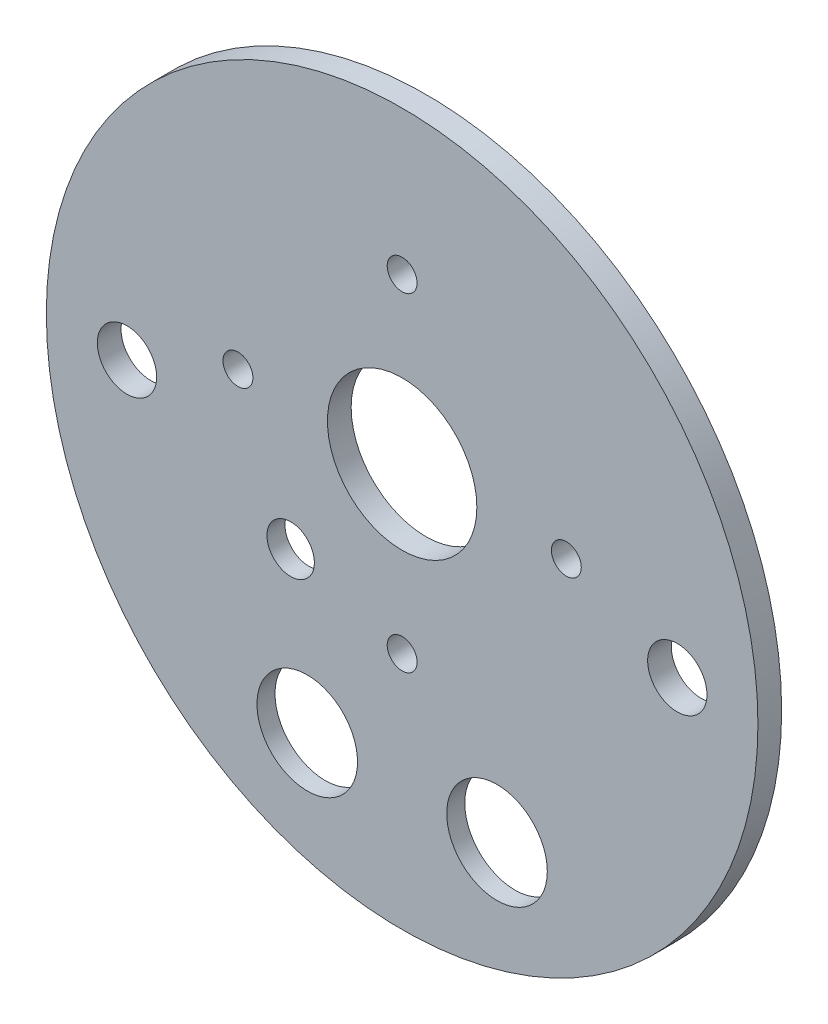
ISO-10303-21;
HEADER;
FILE_DESCRIPTION(('STEP AP214'),'2;1');
FILE_NAME('part.step','',(''),(''),'','','');
FILE_SCHEMA(('AUTOMOTIVE_DESIGN { 1 0 10303 214 1 1 1 1 }'));
ENDSEC;
DATA;
#1=APPLICATION_CONTEXT('core data for automotive mechanical design processes');
#2=APPLICATION_PROTOCOL_DEFINITION('international standard','automotive_design',2000,#1);
#3=PRODUCT_CONTEXT('',#1,'mechanical');
#4=PRODUCT('Part','Part','',(#3));
#5=PRODUCT_RELATED_PRODUCT_CATEGORY('part','',(#4));
#6=PRODUCT_DEFINITION_FORMATION('','',#4);
#7=PRODUCT_DEFINITION_CONTEXT('part definition',#1,'design');
#8=PRODUCT_DEFINITION('design','',#6,#7);
#9=PRODUCT_DEFINITION_SHAPE('','',#8);
#10=(LENGTH_UNIT() NAMED_UNIT(*) SI_UNIT(.MILLI.,.METRE.));
#11=(NAMED_UNIT(*) PLANE_ANGLE_UNIT() SI_UNIT($,.RADIAN.));
#12=(NAMED_UNIT(*) SI_UNIT($,.STERADIAN.) SOLID_ANGLE_UNIT());
#13=UNCERTAINTY_MEASURE_WITH_UNIT(LENGTH_MEASURE(1.E-05),#10,'distance_accuracy_value','');
#14=(GEOMETRIC_REPRESENTATION_CONTEXT(3) GLOBAL_UNCERTAINTY_ASSIGNED_CONTEXT((#13)) GLOBAL_UNIT_ASSIGNED_CONTEXT((#10,
#11,#12)) REPRESENTATION_CONTEXT('',''));
#15=CARTESIAN_POINT('',(0.,0.,0.));
#16=DIRECTION('',(0.,0.,1.));
#17=DIRECTION('',(1.,0.,0.));
#18=AXIS2_PLACEMENT_3D('',#15,#16,#17);
#19=CARTESIAN_POINT('',(-12.7,-31.1667936271924,0.));
#20=DIRECTION('',(0.,0.,1.));
#21=DIRECTION('',(1.,0.,0.));
#22=AXIS2_PLACEMENT_3D('',#19,#20,#21);
#23=CYLINDRICAL_SURFACE('',#22,6.731);
#24=CARTESIAN_POINT('',(-12.7,-31.1667936271924,8.255));
#25=DIRECTION('',(0.,0.,1.));
#26=DIRECTION('',(1.,0.,0.));
#27=AXIS2_PLACEMENT_3D('',#24,#25,#26);
#28=CIRCLE('',#27,6.731);
#29=CARTESIAN_POINT('',(-5.969,-31.1667936271924,8.255));
#30=VERTEX_POINT('',#29);
#31=EDGE_CURVE('E40',#30,#30,#28,.T.);
#32=ORIENTED_EDGE('',*,*,#31,.T.);
#33=EDGE_LOOP('',(#32));
#34=FACE_BOUND('',#33,.T.);
#35=CARTESIAN_POINT('',(-12.7,-31.1667936271924,5.842));
#36=DIRECTION('',(0.,0.,-1.));
#37=DIRECTION('',(-1.,0.,0.));
#38=AXIS2_PLACEMENT_3D('',#35,#36,#37);
#39=CIRCLE('',#38,6.731);
#40=CARTESIAN_POINT('',(-19.431,-31.1667936271924,5.842));
#41=VERTEX_POINT('',#40);
#42=EDGE_CURVE('E36',#41,#41,#39,.F.);
#43=ORIENTED_EDGE('',*,*,#42,.F.);
#44=EDGE_LOOP('',(#43));
#45=FACE_BOUND('',#44,.T.);
#46=ADVANCED_FACE('F32',(#34,#45),#23,.F.);
#47=CARTESIAN_POINT('',(-14.9213454566843,-10.9685752809603,0.));
#48=DIRECTION('',(0.,0.,1.));
#49=DIRECTION('',(1.,0.,0.));
#50=AXIS2_PLACEMENT_3D('',#47,#48,#49);
#51=CYLINDRICAL_SURFACE('',#50,3.175);
#52=CARTESIAN_POINT('',(-14.9213454566843,-10.9685752809603,8.255));
#53=DIRECTION('',(0.,0.,1.));
#54=DIRECTION('',(1.,0.,0.));
#55=AXIS2_PLACEMENT_3D('',#52,#53,#54);
#56=CIRCLE('',#55,3.175);
#57=CARTESIAN_POINT('',(-11.7463454566843,-10.9685752809603,8.255));
#58=VERTEX_POINT('',#57);
#59=EDGE_CURVE('E125',#58,#58,#56,.T.);
#60=ORIENTED_EDGE('',*,*,#59,.T.);
#61=EDGE_LOOP('',(#60));
#62=FACE_BOUND('',#61,.T.);
#63=CARTESIAN_POINT('',(-14.9213454566843,-10.9685752809603,5.842));
#64=DIRECTION('',(0.,0.,-1.));
#65=DIRECTION('',(-1.,0.,0.));
#66=AXIS2_PLACEMENT_3D('',#63,#64,#65);
#67=CIRCLE('',#66,3.175);
#68=CARTESIAN_POINT('',(-18.0963454566843,-10.9685752809603,5.842));
#69=VERTEX_POINT('',#68);
#70=EDGE_CURVE('E55',#69,#69,#67,.F.);
#71=ORIENTED_EDGE('',*,*,#70,.F.);
#72=EDGE_LOOP('',(#71));
#73=FACE_BOUND('',#72,.T.);
#74=ADVANCED_FACE('F66',(#62,#73),#51,.F.);
#75=CARTESIAN_POINT('',(12.7,-31.1667936271924,0.));
#76=DIRECTION('',(0.,0.,1.));
#77=DIRECTION('',(1.,0.,0.));
#78=AXIS2_PLACEMENT_3D('',#75,#76,#77);
#79=CYLINDRICAL_SURFACE('',#78,6.731);
#80=CARTESIAN_POINT('',(12.7,-31.1667936271924,8.255));
#81=DIRECTION('',(0.,0.,1.));
#82=DIRECTION('',(1.,0.,0.));
#83=AXIS2_PLACEMENT_3D('',#80,#81,#82);
#84=CIRCLE('',#83,6.731);
#85=CARTESIAN_POINT('',(19.431,-31.1667936271924,8.255));
#86=VERTEX_POINT('',#85);
#87=EDGE_CURVE('E45',#86,#86,#84,.T.);
#88=ORIENTED_EDGE('',*,*,#87,.T.);
#89=EDGE_LOOP('',(#88));
#90=FACE_BOUND('',#89,.T.);
#91=CARTESIAN_POINT('',(12.7,-31.1667936271924,5.842));
#92=DIRECTION('',(0.,0.,-1.));
#93=DIRECTION('',(-1.,0.,0.));
#94=AXIS2_PLACEMENT_3D('',#91,#92,#93);
#95=CIRCLE('',#94,6.731);
#96=CARTESIAN_POINT('',(5.96899999999999,-31.1667936271924,5.842));
#97=VERTEX_POINT('',#96);
#98=EDGE_CURVE('E53',#97,#97,#95,.F.);
#99=ORIENTED_EDGE('',*,*,#98,.F.);
#100=EDGE_LOOP('',(#99));
#101=FACE_BOUND('',#100,.T.);
#102=ADVANCED_FACE('F72',(#90,#101),#79,.F.);
#103=CARTESIAN_POINT('',(0.,28.3268787592779,0.));
#104=DIRECTION('',(0.,0.,1.));
#105=DIRECTION('',(1.,0.,0.));
#106=AXIS2_PLACEMENT_3D('',#103,#104,#105);
#107=CYLINDRICAL_SURFACE('',#106,2.);
#108=CARTESIAN_POINT('',(0.,28.3268787592779,8.255));
#109=DIRECTION('',(0.,0.,1.));
#110=DIRECTION('',(1.,0.,0.));
#111=AXIS2_PLACEMENT_3D('',#108,#109,#110);
#112=CIRCLE('',#111,2.);
#113=CARTESIAN_POINT('',(2.,28.3268787592779,8.255));
#114=VERTEX_POINT('',#113);
#115=EDGE_CURVE('E121',#114,#114,#112,.T.);
#116=ORIENTED_EDGE('',*,*,#115,.T.);
#117=EDGE_LOOP('',(#116));
#118=FACE_BOUND('',#117,.T.);
#119=CARTESIAN_POINT('',(0.,28.3268787592779,5.08));
#120=DIRECTION('',(0.,0.,-1.));
#121=DIRECTION('',(-1.,0.,0.));
#122=AXIS2_PLACEMENT_3D('',#119,#120,#121);
#123=CIRCLE('',#122,2.);
#124=CARTESIAN_POINT('',(-2.00000000000001,28.3268787592779,5.08));
#125=VERTEX_POINT('',#124);
#126=EDGE_CURVE('E131',#125,#125,#123,.F.);
#127=ORIENTED_EDGE('',*,*,#126,.F.);
#128=EDGE_LOOP('',(#127));
#129=FACE_BOUND('',#128,.T.);
#130=ADVANCED_FACE('F163',(#118,#129),#107,.F.);
#131=CARTESIAN_POINT('',(36.83,0.,0.));
#132=DIRECTION('',(0.,0.,1.));
#133=DIRECTION('',(1.,0.,0.));
#134=AXIS2_PLACEMENT_3D('',#131,#132,#133);
#135=CYLINDRICAL_SURFACE('',#134,3.96875);
#136=CARTESIAN_POINT('',(36.83,0.,8.255));
#137=DIRECTION('',(0.,0.,1.));
#138=DIRECTION('',(1.,0.,0.));
#139=AXIS2_PLACEMENT_3D('',#136,#137,#138);
#140=CIRCLE('',#139,3.96875);
#141=CARTESIAN_POINT('',(40.79875,0.,8.255));
#142=VERTEX_POINT('',#141);
#143=EDGE_CURVE('E117',#142,#142,#140,.T.);
#144=ORIENTED_EDGE('',*,*,#143,.T.);
#145=EDGE_LOOP('',(#144));
#146=FACE_BOUND('',#145,.T.);
#147=CARTESIAN_POINT('',(36.83,0.,5.08));
#148=DIRECTION('',(0.,0.,-1.));
#149=DIRECTION('',(-1.,0.,0.));
#150=AXIS2_PLACEMENT_3D('',#147,#148,#149);
#151=CIRCLE('',#150,3.96875);
#152=CARTESIAN_POINT('',(32.86125,0.,5.08));
#153=VERTEX_POINT('',#152);
#154=EDGE_CURVE('E149',#153,#153,#151,.F.);
#155=ORIENTED_EDGE('',*,*,#154,.F.);
#156=EDGE_LOOP('',(#155));
#157=FACE_BOUND('',#156,.T.);
#158=ADVANCED_FACE('F144',(#146,#157),#135,.F.);
#159=CARTESIAN_POINT('',(-36.83,0.,0.));
#160=DIRECTION('',(0.,0.,1.));
#161=DIRECTION('',(1.,0.,0.));
#162=AXIS2_PLACEMENT_3D('',#159,#160,#161);
#163=CYLINDRICAL_SURFACE('',#162,3.96875);
#164=CARTESIAN_POINT('',(-36.83,0.,8.255));
#165=DIRECTION('',(0.,0.,1.));
#166=DIRECTION('',(1.,0.,0.));
#167=AXIS2_PLACEMENT_3D('',#164,#165,#166);
#168=CIRCLE('',#167,3.96875);
#169=CARTESIAN_POINT('',(-32.86125,0.,8.255));
#170=VERTEX_POINT('',#169);
#171=EDGE_CURVE('E113',#170,#170,#168,.T.);
#172=ORIENTED_EDGE('',*,*,#171,.T.);
#173=EDGE_LOOP('',(#172));
#174=FACE_BOUND('',#173,.T.);
#175=CARTESIAN_POINT('',(-36.83,0.,5.08));
#176=DIRECTION('',(0.,0.,-1.));
#177=DIRECTION('',(-1.,0.,0.));
#178=AXIS2_PLACEMENT_3D('',#175,#176,#177);
#179=CIRCLE('',#178,3.96875);
#180=CARTESIAN_POINT('',(-40.79875,0.,5.08));
#181=VERTEX_POINT('',#180);
#182=EDGE_CURVE('E147',#181,#181,#179,.F.);
#183=ORIENTED_EDGE('',*,*,#182,.F.);
#184=EDGE_LOOP('',(#183));
#185=FACE_BOUND('',#184,.T.);
#186=ADVANCED_FACE('F76',(#174,#185),#163,.F.);
#187=CARTESIAN_POINT('',(0.,6.35,0.));
#188=DIRECTION('',(0.,0.,1.));
#189=DIRECTION('',(1.,0.,0.));
#190=AXIS2_PLACEMENT_3D('',#187,#188,#189);
#191=CYLINDRICAL_SURFACE('',#190,10.);
#192=CARTESIAN_POINT('',(0.,6.35,8.255));
#193=DIRECTION('',(0.,0.,1.));
#194=DIRECTION('',(1.,0.,0.));
#195=AXIS2_PLACEMENT_3D('',#192,#193,#194);
#196=CIRCLE('',#195,10.);
#197=CARTESIAN_POINT('',(10.,6.35,8.255));
#198=VERTEX_POINT('',#197);
#199=EDGE_CURVE('E106',#198,#198,#196,.T.);
#200=ORIENTED_EDGE('',*,*,#199,.T.);
#201=EDGE_LOOP('',(#200));
#202=FACE_BOUND('',#201,.T.);
#203=CARTESIAN_POINT('',(0.,6.35,5.08));
#204=DIRECTION('',(0.,0.,-1.));
#205=DIRECTION('',(-1.,0.,0.));
#206=AXIS2_PLACEMENT_3D('',#203,#204,#205);
#207=CIRCLE('',#206,10.);
#208=CARTESIAN_POINT('',(-10.,6.35,5.08));
#209=VERTEX_POINT('',#208);
#210=EDGE_CURVE('E150',#209,#209,#207,.F.);
#211=ORIENTED_EDGE('',*,*,#210,.F.);
#212=EDGE_LOOP('',(#211));
#213=FACE_BOUND('',#212,.T.);
#214=ADVANCED_FACE('F143',(#202,#213),#191,.F.);
#215=CARTESIAN_POINT('',(-21.9768787592779,6.35,0.));
#216=DIRECTION('',(0.,0.,1.));
#217=DIRECTION('',(1.,0.,0.));
#218=AXIS2_PLACEMENT_3D('',#215,#216,#217);
#219=CYLINDRICAL_SURFACE('',#218,2.);
#220=CARTESIAN_POINT('',(-21.9768787592779,6.35,8.255));
#221=DIRECTION('',(0.,0.,1.));
#222=DIRECTION('',(1.,0.,0.));
#223=AXIS2_PLACEMENT_3D('',#220,#221,#222);
#224=CIRCLE('',#223,2.);
#225=CARTESIAN_POINT('',(-19.9768787592779,6.35,8.255));
#226=VERTEX_POINT('',#225);
#227=EDGE_CURVE('E102',#226,#226,#224,.T.);
#228=ORIENTED_EDGE('',*,*,#227,.T.);
#229=EDGE_LOOP('',(#228));
#230=FACE_BOUND('',#229,.T.);
#231=CARTESIAN_POINT('',(-21.9768787592779,6.35,5.08));
#232=DIRECTION('',(0.,0.,-1.));
#233=DIRECTION('',(-1.,0.,0.));
#234=AXIS2_PLACEMENT_3D('',#231,#232,#233);
#235=CIRCLE('',#234,2.);
#236=CARTESIAN_POINT('',(-23.9768787592779,6.35,5.08));
#237=VERTEX_POINT('',#236);
#238=EDGE_CURVE('E155',#237,#237,#235,.F.);
#239=ORIENTED_EDGE('',*,*,#238,.F.);
#240=EDGE_LOOP('',(#239));
#241=FACE_BOUND('',#240,.T.);
#242=ADVANCED_FACE('F178',(#230,#241),#219,.F.);
#243=CARTESIAN_POINT('',(0.,-15.6268787592779,0.));
#244=DIRECTION('',(0.,0.,1.));
#245=DIRECTION('',(1.,0.,0.));
#246=AXIS2_PLACEMENT_3D('',#243,#244,#245);
#247=CYLINDRICAL_SURFACE('',#246,2.);
#248=CARTESIAN_POINT('',(0.,-15.6268787592779,8.255));
#249=DIRECTION('',(0.,0.,1.));
#250=DIRECTION('',(1.,0.,0.));
#251=AXIS2_PLACEMENT_3D('',#248,#249,#250);
#252=CIRCLE('',#251,2.);
#253=CARTESIAN_POINT('',(2.,-15.6268787592779,8.255));
#254=VERTEX_POINT('',#253);
#255=EDGE_CURVE('E98',#254,#254,#252,.T.);
#256=ORIENTED_EDGE('',*,*,#255,.T.);
#257=EDGE_LOOP('',(#256));
#258=FACE_BOUND('',#257,.T.);
#259=CARTESIAN_POINT('',(0.,-15.6268787592779,5.08));
#260=DIRECTION('',(0.,0.,-1.));
#261=DIRECTION('',(-1.,0.,0.));
#262=AXIS2_PLACEMENT_3D('',#259,#260,#261);
#263=CIRCLE('',#262,2.);
#264=CARTESIAN_POINT('',(-2.,-15.6268787592779,5.08));
#265=VERTEX_POINT('',#264);
#266=EDGE_CURVE('E52',#265,#265,#263,.F.);
#267=ORIENTED_EDGE('',*,*,#266,.F.);
#268=EDGE_LOOP('',(#267));
#269=FACE_BOUND('',#268,.T.);
#270=ADVANCED_FACE('F175',(#258,#269),#247,.F.);
#271=CARTESIAN_POINT('',(21.9768787592779,6.35,0.));
#272=DIRECTION('',(0.,0.,1.));
#273=DIRECTION('',(1.,0.,0.));
#274=AXIS2_PLACEMENT_3D('',#271,#272,#273);
#275=CYLINDRICAL_SURFACE('',#274,2.);
#276=CARTESIAN_POINT('',(21.9768787592779,6.35,8.255));
#277=DIRECTION('',(0.,0.,1.));
#278=DIRECTION('',(1.,0.,0.));
#279=AXIS2_PLACEMENT_3D('',#276,#277,#278);
#280=CIRCLE('',#279,2.);
#281=CARTESIAN_POINT('',(23.9768787592779,6.35,8.255));
#282=VERTEX_POINT('',#281);
#283=EDGE_CURVE('E94',#282,#282,#280,.T.);
#284=ORIENTED_EDGE('',*,*,#283,.T.);
#285=EDGE_LOOP('',(#284));
#286=FACE_BOUND('',#285,.T.);
#287=CARTESIAN_POINT('',(21.9768787592779,6.35,5.08));
#288=DIRECTION('',(0.,0.,-1.));
#289=DIRECTION('',(-1.,0.,0.));
#290=AXIS2_PLACEMENT_3D('',#287,#288,#289);
#291=CIRCLE('',#290,2.);
#292=CARTESIAN_POINT('',(19.9768787592779,6.35,5.08));
#293=VERTEX_POINT('',#292);
#294=EDGE_CURVE('E49',#293,#293,#291,.F.);
#295=ORIENTED_EDGE('',*,*,#294,.F.);
#296=EDGE_LOOP('',(#295));
#297=FACE_BOUND('',#296,.T.);
#298=ADVANCED_FACE('F89',(#286,#297),#275,.F.);
#299=CARTESIAN_POINT('',(0.,0.,8.255));
#300=DIRECTION('',(0.,0.,-1.));
#301=DIRECTION('',(-1.,0.,0.));
#302=AXIS2_PLACEMENT_3D('',#299,#300,#301);
#303=CYLINDRICAL_SURFACE('',#302,47.625);
#304=CARTESIAN_POINT('',(0.,0.,8.255));
#305=DIRECTION('',(0.,0.,1.));
#306=DIRECTION('',(1.,0.,0.));
#307=AXIS2_PLACEMENT_3D('',#304,#305,#306);
#308=CIRCLE('',#307,47.625);
#309=CARTESIAN_POINT('',(47.625,0.,8.255));
#310=VERTEX_POINT('',#309);
#311=EDGE_CURVE('E10',#310,#310,#308,.T.);
#312=ORIENTED_EDGE('',*,*,#311,.F.);
#313=EDGE_LOOP('',(#312));
#314=FACE_BOUND('',#313,.T.);
#315=CARTESIAN_POINT('',(0.,0.,5.08));
#316=DIRECTION('',(0.,0.,-1.));
#317=DIRECTION('',(-1.,0.,0.));
#318=AXIS2_PLACEMENT_3D('',#315,#316,#317);
#319=CIRCLE('',#318,47.625);
#320=CARTESIAN_POINT('',(-47.625,0.,5.08));
#321=VERTEX_POINT('',#320);
#322=EDGE_CURVE('E127',#321,#321,#319,.T.);
#323=ORIENTED_EDGE('',*,*,#322,.F.);
#324=EDGE_LOOP('',(#323));
#325=FACE_BOUND('',#324,.T.);
#326=ADVANCED_FACE('F34',(#314,#325),#303,.T.);
#327=CARTESIAN_POINT('',(0.,0.,8.255));
#328=DIRECTION('',(0.,0.,1.));
#329=DIRECTION('',(1.,0.,0.));
#330=AXIS2_PLACEMENT_3D('',#327,#328,#329);
#331=PLANE('',#330);
#332=ORIENTED_EDGE('',*,*,#283,.F.);
#333=EDGE_LOOP('',(#332));
#334=FACE_BOUND('',#333,.T.);
#335=ORIENTED_EDGE('',*,*,#255,.F.);
#336=EDGE_LOOP('',(#335));
#337=FACE_BOUND('',#336,.T.);
#338=ORIENTED_EDGE('',*,*,#227,.F.);
#339=EDGE_LOOP('',(#338));
#340=FACE_BOUND('',#339,.T.);
#341=ORIENTED_EDGE('',*,*,#199,.F.);
#342=EDGE_LOOP('',(#341));
#343=FACE_BOUND('',#342,.T.);
#344=ORIENTED_EDGE('',*,*,#87,.F.);
#345=EDGE_LOOP('',(#344));
#346=FACE_BOUND('',#345,.T.);
#347=ORIENTED_EDGE('',*,*,#171,.F.);
#348=EDGE_LOOP('',(#347));
#349=FACE_BOUND('',#348,.T.);
#350=ORIENTED_EDGE('',*,*,#143,.F.);
#351=EDGE_LOOP('',(#350));
#352=FACE_BOUND('',#351,.T.);
#353=ORIENTED_EDGE('',*,*,#115,.F.);
#354=EDGE_LOOP('',(#353));
#355=FACE_BOUND('',#354,.T.);
#356=ORIENTED_EDGE('',*,*,#59,.F.);
#357=EDGE_LOOP('',(#356));
#358=FACE_BOUND('',#357,.T.);
#359=ORIENTED_EDGE('',*,*,#31,.F.);
#360=EDGE_LOOP('',(#359));
#361=FACE_BOUND('',#360,.T.);
#362=ORIENTED_EDGE('',*,*,#311,.T.);
#363=EDGE_LOOP('',(#362));
#364=FACE_BOUND('',#363,.T.);
#365=ADVANCED_FACE('F78',(#334,#337,#340,#343,#346,#349,#352,#355,#358,#361,#364),#331,.T.);
#366=CARTESIAN_POINT('',(0.,0.,5.08));
#367=DIRECTION('',(0.,0.,-1.));
#368=DIRECTION('',(-1.,0.,0.));
#369=AXIS2_PLACEMENT_3D('',#366,#367,#368);
#370=PLANE('',#369);
#371=CARTESIAN_POINT('',(12.7,-31.1667936271924,5.08));
#372=DIRECTION('',(0.,0.,-1.));
#373=DIRECTION('',(-1.,0.,0.));
#374=AXIS2_PLACEMENT_3D('',#371,#372,#373);
#375=CIRCLE('',#374,11.176);
#376=CARTESIAN_POINT('',(1.524,-31.1667936271924,5.08));
#377=VERTEX_POINT('',#376);
#378=EDGE_CURVE('E217',#377,#377,#375,.T.);
#379=ORIENTED_EDGE('',*,*,#378,.F.);
#380=EDGE_LOOP('',(#379));
#381=FACE_BOUND('',#380,.T.);
#382=CARTESIAN_POINT('',(-12.7,-31.1667936271924,5.08));
#383=DIRECTION('',(0.,0.,-1.));
#384=DIRECTION('',(-1.,0.,0.));
#385=AXIS2_PLACEMENT_3D('',#382,#383,#384);
#386=CIRCLE('',#385,11.176);
#387=CARTESIAN_POINT('',(-23.876,-31.1667936271924,5.08));
#388=VERTEX_POINT('',#387);
#389=EDGE_CURVE('E225',#388,#388,#386,.T.);
#390=ORIENTED_EDGE('',*,*,#389,.F.);
#391=EDGE_LOOP('',(#390));
#392=FACE_BOUND('',#391,.T.);
#393=CARTESIAN_POINT('',(-14.9213454566843,-10.9685752809603,5.08));
#394=DIRECTION('',(0.,0.,-1.));
#395=DIRECTION('',(-1.,0.,0.));
#396=AXIS2_PLACEMENT_3D('',#393,#394,#395);
#397=CIRCLE('',#396,6.35);
#398=CARTESIAN_POINT('',(-21.2713454566843,-10.9685752809603,5.08));
#399=VERTEX_POINT('',#398);
#400=EDGE_CURVE('E231',#399,#399,#397,.T.);
#401=ORIENTED_EDGE('',*,*,#400,.F.);
#402=EDGE_LOOP('',(#401));
#403=FACE_BOUND('',#402,.T.);
#404=ORIENTED_EDGE('',*,*,#126,.T.);
#405=EDGE_LOOP('',(#404));
#406=FACE_BOUND('',#405,.T.);
#407=ORIENTED_EDGE('',*,*,#154,.T.);
#408=EDGE_LOOP('',(#407));
#409=FACE_BOUND('',#408,.T.);
#410=ORIENTED_EDGE('',*,*,#182,.T.);
#411=EDGE_LOOP('',(#410));
#412=FACE_BOUND('',#411,.T.);
#413=ORIENTED_EDGE('',*,*,#210,.T.);
#414=EDGE_LOOP('',(#413));
#415=FACE_BOUND('',#414,.T.);
#416=ORIENTED_EDGE('',*,*,#238,.T.);
#417=EDGE_LOOP('',(#416));
#418=FACE_BOUND('',#417,.T.);
#419=ORIENTED_EDGE('',*,*,#266,.T.);
#420=EDGE_LOOP('',(#419));
#421=FACE_BOUND('',#420,.T.);
#422=ORIENTED_EDGE('',*,*,#294,.T.);
#423=EDGE_LOOP('',(#422));
#424=FACE_BOUND('',#423,.T.);
#425=ORIENTED_EDGE('',*,*,#322,.T.);
#426=EDGE_LOOP('',(#425));
#427=FACE_BOUND('',#426,.T.);
#428=ADVANCED_FACE('F80',(#381,#392,#403,#406,#409,#412,#415,#418,#421,#424,#427),#370,.T.);
#429=CARTESIAN_POINT('',(-14.9213454566843,-10.9685752809603,5.842));
#430=DIRECTION('',(0.,0.,-1.));
#431=DIRECTION('',(-1.,0.,0.));
#432=AXIS2_PLACEMENT_3D('',#429,#430,#431);
#433=PLANE('',#432);
#434=CARTESIAN_POINT('',(-14.9213454566843,-10.9685752809603,5.842));
#435=DIRECTION('',(0.,0.,-1.));
#436=DIRECTION('',(-1.,0.,0.));
#437=AXIS2_PLACEMENT_3D('',#434,#435,#436);
#438=CIRCLE('',#437,6.35);
#439=CARTESIAN_POINT('',(-21.2713454566843,-10.9685752809603,5.842));
#440=VERTEX_POINT('',#439);
#441=EDGE_CURVE('E228',#440,#440,#438,.T.);
#442=ORIENTED_EDGE('',*,*,#441,.T.);
#443=EDGE_LOOP('',(#442));
#444=FACE_BOUND('',#443,.T.);
#445=ORIENTED_EDGE('',*,*,#70,.T.);
#446=EDGE_LOOP('',(#445));
#447=FACE_BOUND('',#446,.T.);
#448=ADVANCED_FACE('F86',(#444,#447),#433,.T.);
#449=CARTESIAN_POINT('',(-14.9213454566843,-10.9685752809603,5.842));
#450=DIRECTION('',(0.,0.,-1.));
#451=DIRECTION('',(-1.,0.,0.));
#452=AXIS2_PLACEMENT_3D('',#449,#450,#451);
#453=CYLINDRICAL_SURFACE('',#452,6.35);
#454=ORIENTED_EDGE('',*,*,#441,.F.);
#455=EDGE_LOOP('',(#454));
#456=FACE_BOUND('',#455,.T.);
#457=ORIENTED_EDGE('',*,*,#400,.T.);
#458=EDGE_LOOP('',(#457));
#459=FACE_BOUND('',#458,.T.);
#460=ADVANCED_FACE('F189',(#456,#459),#453,.F.);
#461=CARTESIAN_POINT('',(-12.7,-31.1667936271924,5.842));
#462=DIRECTION('',(0.,0.,-1.));
#463=DIRECTION('',(-1.,0.,0.));
#464=AXIS2_PLACEMENT_3D('',#461,#462,#463);
#465=PLANE('',#464);
#466=CARTESIAN_POINT('',(-12.7,-31.1667936271924,5.842));
#467=DIRECTION('',(0.,0.,-1.));
#468=DIRECTION('',(-1.,0.,0.));
#469=AXIS2_PLACEMENT_3D('',#466,#467,#468);
#470=CIRCLE('',#469,11.176);
#471=CARTESIAN_POINT('',(-23.876,-31.1667936271924,5.842));
#472=VERTEX_POINT('',#471);
#473=EDGE_CURVE('E220',#472,#472,#470,.T.);
#474=ORIENTED_EDGE('',*,*,#473,.T.);
#475=EDGE_LOOP('',(#474));
#476=FACE_BOUND('',#475,.T.);
#477=ORIENTED_EDGE('',*,*,#42,.T.);
#478=EDGE_LOOP('',(#477));
#479=FACE_BOUND('',#478,.T.);
#480=ADVANCED_FACE('F63',(#476,#479),#465,.T.);
#481=CARTESIAN_POINT('',(-12.7,-31.1667936271924,5.842));
#482=DIRECTION('',(0.,0.,-1.));
#483=DIRECTION('',(-1.,0.,0.));
#484=AXIS2_PLACEMENT_3D('',#481,#482,#483);
#485=CYLINDRICAL_SURFACE('',#484,11.176);
#486=ORIENTED_EDGE('',*,*,#473,.F.);
#487=EDGE_LOOP('',(#486));
#488=FACE_BOUND('',#487,.T.);
#489=ORIENTED_EDGE('',*,*,#389,.T.);
#490=EDGE_LOOP('',(#489));
#491=FACE_BOUND('',#490,.T.);
#492=ADVANCED_FACE('F196',(#488,#491),#485,.F.);
#493=CARTESIAN_POINT('',(12.7,-31.1667936271924,5.842));
#494=DIRECTION('',(0.,0.,-1.));
#495=DIRECTION('',(-1.,0.,0.));
#496=AXIS2_PLACEMENT_3D('',#493,#494,#495);
#497=PLANE('',#496);
#498=CARTESIAN_POINT('',(12.7,-31.1667936271924,5.842));
#499=DIRECTION('',(0.,0.,-1.));
#500=DIRECTION('',(-1.,0.,0.));
#501=AXIS2_PLACEMENT_3D('',#498,#499,#500);
#502=CIRCLE('',#501,11.176);
#503=CARTESIAN_POINT('',(1.524,-31.1667936271924,5.842));
#504=VERTEX_POINT('',#503);
#505=EDGE_CURVE('E56',#504,#504,#502,.T.);
#506=ORIENTED_EDGE('',*,*,#505,.T.);
#507=EDGE_LOOP('',(#506));
#508=FACE_BOUND('',#507,.T.);
#509=ORIENTED_EDGE('',*,*,#98,.T.);
#510=EDGE_LOOP('',(#509));
#511=FACE_BOUND('',#510,.T.);
#512=ADVANCED_FACE('F199',(#508,#511),#497,.T.);
#513=CARTESIAN_POINT('',(12.7,-31.1667936271924,5.842));
#514=DIRECTION('',(0.,0.,-1.));
#515=DIRECTION('',(-1.,0.,0.));
#516=AXIS2_PLACEMENT_3D('',#513,#514,#515);
#517=CYLINDRICAL_SURFACE('',#516,11.176);
#518=ORIENTED_EDGE('',*,*,#505,.F.);
#519=EDGE_LOOP('',(#518));
#520=FACE_BOUND('',#519,.T.);
#521=ORIENTED_EDGE('',*,*,#378,.T.);
#522=EDGE_LOOP('',(#521));
#523=FACE_BOUND('',#522,.T.);
#524=ADVANCED_FACE('F204',(#520,#523),#517,.F.);
#525=CLOSED_SHELL('',(#46,#74,#102,#130,#158,#186,#214,#242,#270,#298,#326,#365,#428,#448,#460,
#480,#492,#512,#524));
#526=MANIFOLD_SOLID_BREP('B2',#525);
#527=ADVANCED_BREP_SHAPE_REPRESENTATION('',(#18,#526),#14);
#528=SHAPE_DEFINITION_REPRESENTATION(#9,#527);
ENDSEC;
END-ISO-10303-21;
